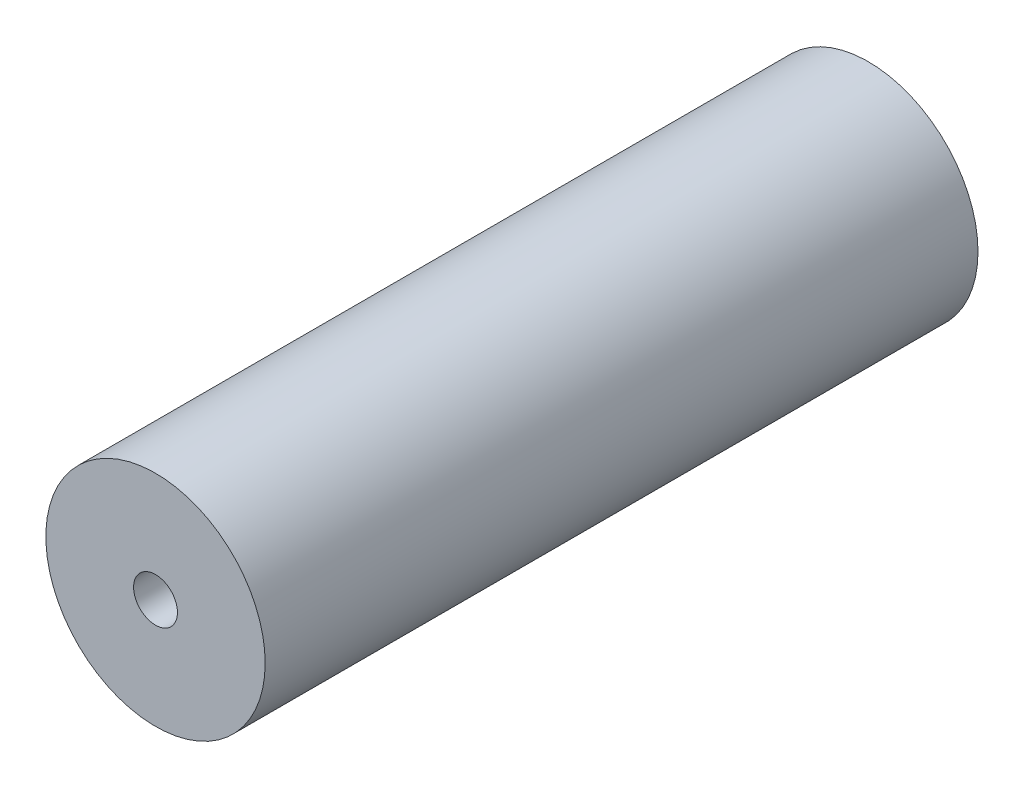
ISO-10303-21;
HEADER;
FILE_DESCRIPTION(('STEP AP214'),'2;1');
FILE_NAME('part.step','',(''),(''),'','','');
FILE_SCHEMA(('AUTOMOTIVE_DESIGN { 1 0 10303 214 1 1 1 1 }'));
ENDSEC;
DATA;
#1=APPLICATION_CONTEXT('core data for automotive mechanical design processes');
#2=APPLICATION_PROTOCOL_DEFINITION('international standard','automotive_design',2000,#1);
#3=PRODUCT_CONTEXT('',#1,'mechanical');
#4=PRODUCT('Part','Part','',(#3));
#5=PRODUCT_RELATED_PRODUCT_CATEGORY('part','',(#4));
#6=PRODUCT_DEFINITION_FORMATION('','',#4);
#7=PRODUCT_DEFINITION_CONTEXT('part definition',#1,'design');
#8=PRODUCT_DEFINITION('design','',#6,#7);
#9=PRODUCT_DEFINITION_SHAPE('','',#8);
#10=(LENGTH_UNIT() NAMED_UNIT(*) SI_UNIT(.MILLI.,.METRE.));
#11=(NAMED_UNIT(*) PLANE_ANGLE_UNIT() SI_UNIT($,.RADIAN.));
#12=(NAMED_UNIT(*) SI_UNIT($,.STERADIAN.) SOLID_ANGLE_UNIT());
#13=UNCERTAINTY_MEASURE_WITH_UNIT(LENGTH_MEASURE(1.E-05),#10,'distance_accuracy_value','');
#14=(GEOMETRIC_REPRESENTATION_CONTEXT(3) GLOBAL_UNCERTAINTY_ASSIGNED_CONTEXT((#13)) GLOBAL_UNIT_ASSIGNED_CONTEXT((#10,
#11,#12)) REPRESENTATION_CONTEXT('',''));
#15=CARTESIAN_POINT('',(0.,0.,0.));
#16=DIRECTION('',(0.,0.,1.));
#17=DIRECTION('',(1.,0.,0.));
#18=AXIS2_PLACEMENT_3D('',#15,#16,#17);
#19=CARTESIAN_POINT('',(0.,0.,65.));
#20=DIRECTION('',(0.,0.,1.));
#21=DIRECTION('',(1.,0.,0.));
#22=AXIS2_PLACEMENT_3D('',#19,#20,#21);
#23=PLANE('',#22);
#24=CARTESIAN_POINT('',(0.,0.,65.));
#25=DIRECTION('',(0.,0.,1.));
#26=DIRECTION('',(1.,0.,0.));
#27=AXIS2_PLACEMENT_3D('',#24,#25,#26);
#28=CIRCLE('',#27,10.);
#29=CARTESIAN_POINT('',(10.,0.,65.));
#30=VERTEX_POINT('',#29);
#31=EDGE_CURVE('E10',#30,#30,#28,.T.);
#32=ORIENTED_EDGE('',*,*,#31,.T.);
#33=EDGE_LOOP('',(#32));
#34=FACE_BOUND('',#33,.T.);
#35=CARTESIAN_POINT('',(0.,0.,65.));
#36=DIRECTION('',(0.,0.,1.));
#37=DIRECTION('',(1.,0.,0.));
#38=AXIS2_PLACEMENT_3D('',#35,#36,#37);
#39=CIRCLE('',#38,2.);
#40=CARTESIAN_POINT('',(2.,0.,65.));
#41=VERTEX_POINT('',#40);
#42=EDGE_CURVE('E41',#41,#41,#39,.T.);
#43=ORIENTED_EDGE('',*,*,#42,.F.);
#44=EDGE_LOOP('',(#43));
#45=FACE_BOUND('',#44,.T.);
#46=ADVANCED_FACE('F30',(#34,#45),#23,.T.);
#47=CARTESIAN_POINT('',(0.,0.,0.));
#48=DIRECTION('',(0.,0.,1.));
#49=DIRECTION('',(1.,0.,0.));
#50=AXIS2_PLACEMENT_3D('',#47,#48,#49);
#51=PLANE('',#50);
#52=CARTESIAN_POINT('',(0.,0.,0.));
#53=DIRECTION('',(0.,0.,1.));
#54=DIRECTION('',(1.,0.,0.));
#55=AXIS2_PLACEMENT_3D('',#52,#53,#54);
#56=CIRCLE('',#55,10.);
#57=CARTESIAN_POINT('',(10.,0.,0.));
#58=VERTEX_POINT('',#57);
#59=EDGE_CURVE('E34',#58,#58,#56,.T.);
#60=ORIENTED_EDGE('',*,*,#59,.F.);
#61=EDGE_LOOP('',(#60));
#62=FACE_BOUND('',#61,.T.);
#63=CARTESIAN_POINT('',(0.,0.,0.));
#64=DIRECTION('',(0.,0.,1.));
#65=DIRECTION('',(1.,0.,0.));
#66=AXIS2_PLACEMENT_3D('',#63,#64,#65);
#67=CIRCLE('',#66,2.);
#68=CARTESIAN_POINT('',(2.,0.,0.));
#69=VERTEX_POINT('',#68);
#70=EDGE_CURVE('E43',#69,#69,#67,.T.);
#71=ORIENTED_EDGE('',*,*,#70,.T.);
#72=EDGE_LOOP('',(#71));
#73=FACE_BOUND('',#72,.T.);
#74=ADVANCED_FACE('F53',(#62,#73),#51,.F.);
#75=CARTESIAN_POINT('',(0.,0.,65.));
#76=DIRECTION('',(0.,0.,-1.));
#77=DIRECTION('',(-1.,0.,0.));
#78=AXIS2_PLACEMENT_3D('',#75,#76,#77);
#79=CYLINDRICAL_SURFACE('',#78,10.);
#80=ORIENTED_EDGE('',*,*,#31,.F.);
#81=EDGE_LOOP('',(#80));
#82=FACE_BOUND('',#81,.T.);
#83=ORIENTED_EDGE('',*,*,#59,.T.);
#84=EDGE_LOOP('',(#83));
#85=FACE_BOUND('',#84,.T.);
#86=ADVANCED_FACE('F32',(#82,#85),#79,.T.);
#87=CARTESIAN_POINT('',(0.,0.,65.));
#88=DIRECTION('',(0.,0.,-1.));
#89=DIRECTION('',(-1.,0.,0.));
#90=AXIS2_PLACEMENT_3D('',#87,#88,#89);
#91=CYLINDRICAL_SURFACE('',#90,2.);
#92=ORIENTED_EDGE('',*,*,#42,.T.);
#93=EDGE_LOOP('',(#92));
#94=FACE_BOUND('',#93,.T.);
#95=ORIENTED_EDGE('',*,*,#70,.F.);
#96=EDGE_LOOP('',(#95));
#97=FACE_BOUND('',#96,.T.);
#98=ADVANCED_FACE('F49',(#94,#97),#91,.F.);
#99=CLOSED_SHELL('',(#46,#74,#86,#98));
#100=MANIFOLD_SOLID_BREP('B2',#99);
#101=ADVANCED_BREP_SHAPE_REPRESENTATION('',(#18,#100),#14);
#102=SHAPE_DEFINITION_REPRESENTATION(#9,#101);
ENDSEC;
END-ISO-10303-21;
